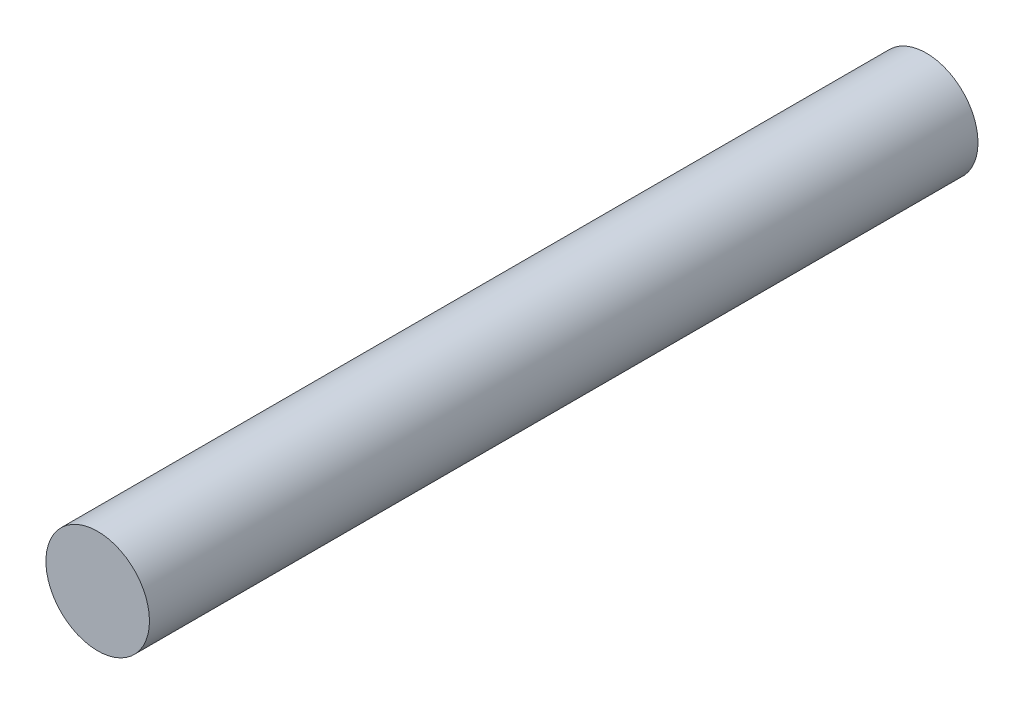
ISO-10303-21;
HEADER;
FILE_DESCRIPTION(('STEP AP214'),'2;1');
FILE_NAME('part.step','',(''),(''),'','','');
FILE_SCHEMA(('AUTOMOTIVE_DESIGN { 1 0 10303 214 1 1 1 1 }'));
ENDSEC;
DATA;
#1=APPLICATION_CONTEXT('core data for automotive mechanical design processes');
#2=APPLICATION_PROTOCOL_DEFINITION('international standard','automotive_design',2000,#1);
#3=PRODUCT_CONTEXT('',#1,'mechanical');
#4=PRODUCT('Part','Part','',(#3));
#5=PRODUCT_RELATED_PRODUCT_CATEGORY('part','',(#4));
#6=PRODUCT_DEFINITION_FORMATION('','',#4);
#7=PRODUCT_DEFINITION_CONTEXT('part definition',#1,'design');
#8=PRODUCT_DEFINITION('design','',#6,#7);
#9=PRODUCT_DEFINITION_SHAPE('','',#8);
#10=(LENGTH_UNIT() NAMED_UNIT(*) SI_UNIT(.MILLI.,.METRE.));
#11=(NAMED_UNIT(*) PLANE_ANGLE_UNIT() SI_UNIT($,.RADIAN.));
#12=(NAMED_UNIT(*) SI_UNIT($,.STERADIAN.) SOLID_ANGLE_UNIT());
#13=UNCERTAINTY_MEASURE_WITH_UNIT(LENGTH_MEASURE(1.E-05),#10,'distance_accuracy_value','');
#14=(GEOMETRIC_REPRESENTATION_CONTEXT(3) GLOBAL_UNCERTAINTY_ASSIGNED_CONTEXT((#13)) GLOBAL_UNIT_ASSIGNED_CONTEXT((#10,
#11,#12)) REPRESENTATION_CONTEXT('',''));
#15=CARTESIAN_POINT('',(0.,0.,0.));
#16=DIRECTION('',(0.,0.,1.));
#17=DIRECTION('',(1.,0.,0.));
#18=AXIS2_PLACEMENT_3D('',#15,#16,#17);
#19=CARTESIAN_POINT('',(0.,0.,24.));
#20=DIRECTION('',(0.,0.,-1.));
#21=DIRECTION('',(-1.,0.,0.));
#22=AXIS2_PLACEMENT_3D('',#19,#20,#21);
#23=CYLINDRICAL_SURFACE('',#22,1.5);
#24=CARTESIAN_POINT('',(0.,0.,24.));
#25=DIRECTION('',(0.,0.,1.));
#26=DIRECTION('',(1.,0.,0.));
#27=AXIS2_PLACEMENT_3D('',#24,#25,#26);
#28=CIRCLE('',#27,1.5);
#29=CARTESIAN_POINT('',(1.5,0.,24.));
#30=VERTEX_POINT('',#29);
#31=EDGE_CURVE('E10',#30,#30,#28,.T.);
#32=ORIENTED_EDGE('',*,*,#31,.F.);
#33=EDGE_LOOP('',(#32));
#34=FACE_BOUND('',#33,.T.);
#35=CARTESIAN_POINT('',(0.,0.,0.));
#36=DIRECTION('',(0.,0.,1.));
#37=DIRECTION('',(1.,0.,0.));
#38=AXIS2_PLACEMENT_3D('',#35,#36,#37);
#39=CIRCLE('',#38,1.5);
#40=CARTESIAN_POINT('',(1.5,0.,0.));
#41=VERTEX_POINT('',#40);
#42=EDGE_CURVE('E34',#41,#41,#39,.T.);
#43=ORIENTED_EDGE('',*,*,#42,.T.);
#44=EDGE_LOOP('',(#43));
#45=FACE_BOUND('',#44,.T.);
#46=ADVANCED_FACE('F31',(#34,#45),#23,.T.);
#47=CARTESIAN_POINT('',(0.,0.,24.));
#48=DIRECTION('',(0.,0.,1.));
#49=DIRECTION('',(1.,0.,0.));
#50=AXIS2_PLACEMENT_3D('',#47,#48,#49);
#51=PLANE('',#50);
#52=ORIENTED_EDGE('',*,*,#31,.T.);
#53=EDGE_LOOP('',(#52));
#54=FACE_BOUND('',#53,.T.);
#55=ADVANCED_FACE('F46',(#54),#51,.T.);
#56=CARTESIAN_POINT('',(0.,0.,0.));
#57=DIRECTION('',(0.,0.,1.));
#58=DIRECTION('',(1.,0.,0.));
#59=AXIS2_PLACEMENT_3D('',#56,#57,#58);
#60=PLANE('',#59);
#61=ORIENTED_EDGE('',*,*,#42,.F.);
#62=EDGE_LOOP('',(#61));
#63=FACE_BOUND('',#62,.T.);
#64=ADVANCED_FACE('F44',(#63),#60,.F.);
#65=CLOSED_SHELL('',(#46,#55,#64));
#66=MANIFOLD_SOLID_BREP('B2',#65);
#67=ADVANCED_BREP_SHAPE_REPRESENTATION('',(#18,#66),#14);
#68=SHAPE_DEFINITION_REPRESENTATION(#9,#67);
ENDSEC;
END-ISO-10303-21;
